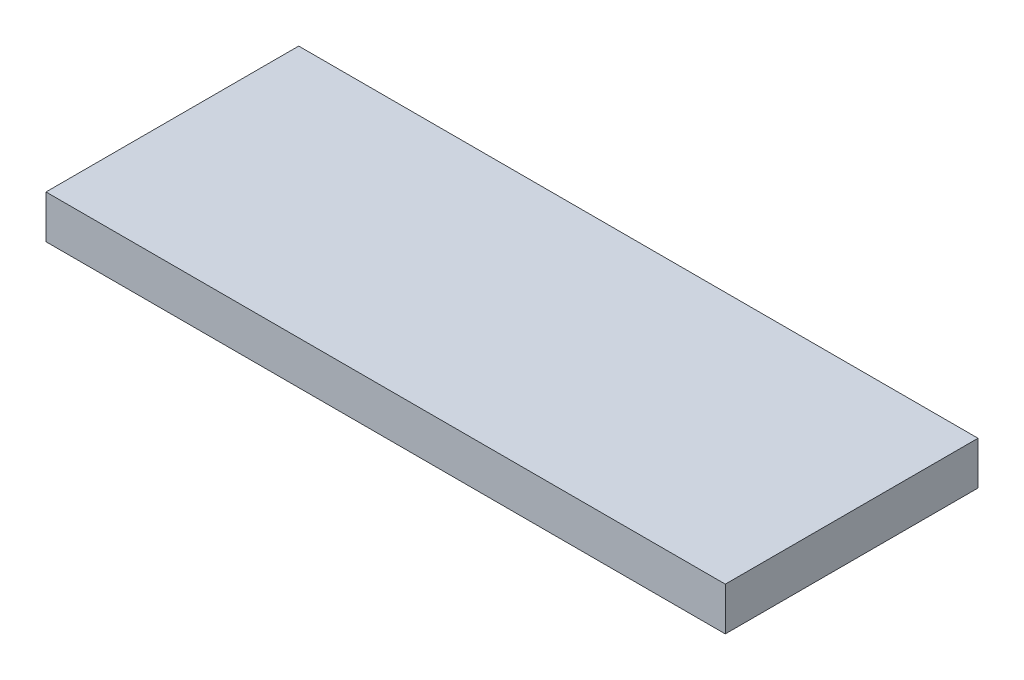
ISO-10303-21;
HEADER;
FILE_DESCRIPTION(('STEP AP214'),'2;1');
FILE_NAME('part.step','',(''),(''),'','','');
FILE_SCHEMA(('AUTOMOTIVE_DESIGN { 1 0 10303 214 1 1 1 1 }'));
ENDSEC;
DATA;
#1=APPLICATION_CONTEXT('core data for automotive mechanical design processes');
#2=APPLICATION_PROTOCOL_DEFINITION('international standard','automotive_design',2000,#1);
#3=PRODUCT_CONTEXT('',#1,'mechanical');
#4=PRODUCT('Part','Part','',(#3));
#5=PRODUCT_RELATED_PRODUCT_CATEGORY('part','',(#4));
#6=PRODUCT_DEFINITION_FORMATION('','',#4);
#7=PRODUCT_DEFINITION_CONTEXT('part definition',#1,'design');
#8=PRODUCT_DEFINITION('design','',#6,#7);
#9=PRODUCT_DEFINITION_SHAPE('','',#8);
#10=(LENGTH_UNIT() NAMED_UNIT(*) SI_UNIT(.MILLI.,.METRE.));
#11=(NAMED_UNIT(*) PLANE_ANGLE_UNIT() SI_UNIT($,.RADIAN.));
#12=(NAMED_UNIT(*) SI_UNIT($,.STERADIAN.) SOLID_ANGLE_UNIT());
#13=UNCERTAINTY_MEASURE_WITH_UNIT(LENGTH_MEASURE(1.E-05),#10,'distance_accuracy_value','');
#14=(GEOMETRIC_REPRESENTATION_CONTEXT(3) GLOBAL_UNCERTAINTY_ASSIGNED_CONTEXT((#13)) GLOBAL_UNIT_ASSIGNED_CONTEXT((#10,
#11,#12)) REPRESENTATION_CONTEXT('',''));
#15=CARTESIAN_POINT('',(0.,0.,0.));
#16=DIRECTION('',(0.,0.,1.));
#17=DIRECTION('',(1.,0.,0.));
#18=AXIS2_PLACEMENT_3D('',#15,#16,#17);
#19=CARTESIAN_POINT('',(0.,3.175,0.));
#20=DIRECTION('',(-1.,0.,0.));
#21=DIRECTION('',(0.,0.,1.));
#22=AXIS2_PLACEMENT_3D('',#19,#20,#21);
#23=PLANE('',#22);
#24=DIRECTION('',(0.,0.,-1.));
#25=VECTOR('',#24,1.);
#26=CARTESIAN_POINT('',(0.,0.,0.));
#27=LINE('',#26,#25);
#28=CARTESIAN_POINT('',(0.,0.,0.));
#29=VERTEX_POINT('',#28);
#30=CARTESIAN_POINT('',(0.,0.,-18.6));
#31=VERTEX_POINT('',#30);
#32=EDGE_CURVE('E98',#29,#31,#27,.T.);
#33=ORIENTED_EDGE('',*,*,#32,.F.);
#34=DIRECTION('',(0.,-1.,0.));
#35=VECTOR('',#34,1.);
#36=CARTESIAN_POINT('',(0.,3.175,0.));
#37=LINE('',#36,#35);
#38=CARTESIAN_POINT('',(0.,3.175,0.));
#39=VERTEX_POINT('',#38);
#40=EDGE_CURVE('E11',#39,#29,#37,.T.);
#41=ORIENTED_EDGE('',*,*,#40,.F.);
#42=DIRECTION('',(0.,0.,-1.));
#43=VECTOR('',#42,1.);
#44=CARTESIAN_POINT('',(0.,3.175,0.));
#45=LINE('',#44,#43);
#46=CARTESIAN_POINT('',(0.,3.175,-18.6));
#47=VERTEX_POINT('',#46);
#48=EDGE_CURVE('E93',#39,#47,#45,.T.);
#49=ORIENTED_EDGE('',*,*,#48,.T.);
#50=DIRECTION('',(0.,-1.,0.));
#51=VECTOR('',#50,1.);
#52=CARTESIAN_POINT('',(0.,3.175,-18.6));
#53=LINE('',#52,#51);
#54=EDGE_CURVE('E36',#47,#31,#53,.T.);
#55=ORIENTED_EDGE('',*,*,#54,.T.);
#56=EDGE_LOOP('',(#33,#41,#49,#55));
#57=FACE_BOUND('',#56,.T.);
#58=ADVANCED_FACE('F33',(#57),#23,.T.);
#59=CARTESIAN_POINT('',(0.,3.175,0.));
#60=DIRECTION('',(0.,0.,-1.));
#61=DIRECTION('',(-1.,0.,0.));
#62=AXIS2_PLACEMENT_3D('',#59,#60,#61);
#63=PLANE('',#62);
#64=DIRECTION('',(1.,0.,0.));
#65=VECTOR('',#64,1.);
#66=CARTESIAN_POINT('',(0.,0.,0.));
#67=LINE('',#66,#65);
#68=CARTESIAN_POINT('',(50.,0.,0.));
#69=VERTEX_POINT('',#68);
#70=EDGE_CURVE('E66',#29,#69,#67,.T.);
#71=ORIENTED_EDGE('',*,*,#70,.T.);
#72=DIRECTION('',(0.,-1.,0.));
#73=VECTOR('',#72,1.);
#74=CARTESIAN_POINT('',(50.,3.175,0.));
#75=LINE('',#74,#73);
#76=CARTESIAN_POINT('',(50.,3.175,0.));
#77=VERTEX_POINT('',#76);
#78=EDGE_CURVE('E42',#77,#69,#75,.T.);
#79=ORIENTED_EDGE('',*,*,#78,.F.);
#80=DIRECTION('',(1.,0.,0.));
#81=VECTOR('',#80,1.);
#82=CARTESIAN_POINT('',(0.,3.175,0.));
#83=LINE('',#82,#81);
#84=EDGE_CURVE('E83',#39,#77,#83,.T.);
#85=ORIENTED_EDGE('',*,*,#84,.F.);
#86=ORIENTED_EDGE('',*,*,#40,.T.);
#87=EDGE_LOOP('',(#71,#79,#85,#86));
#88=FACE_BOUND('',#87,.T.);
#89=ADVANCED_FACE('F108',(#88),#63,.F.);
#90=CARTESIAN_POINT('',(50.,3.175,0.));
#91=DIRECTION('',(-1.,0.,0.));
#92=DIRECTION('',(0.,0.,1.));
#93=AXIS2_PLACEMENT_3D('',#90,#91,#92);
#94=PLANE('',#93);
#95=DIRECTION('',(0.,0.,-1.));
#96=VECTOR('',#95,1.);
#97=CARTESIAN_POINT('',(50.,0.,0.));
#98=LINE('',#97,#96);
#99=CARTESIAN_POINT('',(50.,0.,-18.6));
#100=VERTEX_POINT('',#99);
#101=EDGE_CURVE('E90',#69,#100,#98,.T.);
#102=ORIENTED_EDGE('',*,*,#101,.T.);
#103=DIRECTION('',(0.,-1.,0.));
#104=VECTOR('',#103,1.);
#105=CARTESIAN_POINT('',(50.,3.175,-18.6));
#106=LINE('',#105,#104);
#107=CARTESIAN_POINT('',(50.,3.175,-18.6));
#108=VERTEX_POINT('',#107);
#109=EDGE_CURVE('E87',#108,#100,#106,.T.);
#110=ORIENTED_EDGE('',*,*,#109,.F.);
#111=DIRECTION('',(0.,0.,-1.));
#112=VECTOR('',#111,1.);
#113=CARTESIAN_POINT('',(50.,3.175,0.));
#114=LINE('',#113,#112);
#115=EDGE_CURVE('E78',#77,#108,#114,.T.);
#116=ORIENTED_EDGE('',*,*,#115,.F.);
#117=ORIENTED_EDGE('',*,*,#78,.T.);
#118=EDGE_LOOP('',(#102,#110,#116,#117));
#119=FACE_BOUND('',#118,.T.);
#120=ADVANCED_FACE('F88',(#119),#94,.F.);
#121=CARTESIAN_POINT('',(0.,3.175,-18.6));
#122=DIRECTION('',(0.,0.,-1.));
#123=DIRECTION('',(-1.,0.,0.));
#124=AXIS2_PLACEMENT_3D('',#121,#122,#123);
#125=PLANE('',#124);
#126=DIRECTION('',(1.,0.,0.));
#127=VECTOR('',#126,1.);
#128=CARTESIAN_POINT('',(0.,0.,-18.6));
#129=LINE('',#128,#127);
#130=EDGE_CURVE('E101',#31,#100,#129,.T.);
#131=ORIENTED_EDGE('',*,*,#130,.F.);
#132=ORIENTED_EDGE('',*,*,#54,.F.);
#133=DIRECTION('',(1.,0.,0.));
#134=VECTOR('',#133,1.);
#135=CARTESIAN_POINT('',(0.,3.175,-18.6));
#136=LINE('',#135,#134);
#137=EDGE_CURVE('E82',#47,#108,#136,.T.);
#138=ORIENTED_EDGE('',*,*,#137,.T.);
#139=ORIENTED_EDGE('',*,*,#109,.T.);
#140=EDGE_LOOP('',(#131,#132,#138,#139));
#141=FACE_BOUND('',#140,.T.);
#142=ADVANCED_FACE('F92',(#141),#125,.T.);
#143=CARTESIAN_POINT('',(0.,3.175,0.));
#144=DIRECTION('',(0.,-1.,0.));
#145=DIRECTION('',(0.,0.,-1.));
#146=AXIS2_PLACEMENT_3D('',#143,#144,#145);
#147=PLANE('',#146);
#148=ORIENTED_EDGE('',*,*,#48,.F.);
#149=ORIENTED_EDGE('',*,*,#84,.T.);
#150=ORIENTED_EDGE('',*,*,#115,.T.);
#151=ORIENTED_EDGE('',*,*,#137,.F.);
#152=EDGE_LOOP('',(#148,#149,#150,#151));
#153=FACE_BOUND('',#152,.T.);
#154=ADVANCED_FACE('F81',(#153),#147,.F.);
#155=CARTESIAN_POINT('',(0.,0.,0.));
#156=DIRECTION('',(0.,-1.,0.));
#157=DIRECTION('',(0.,0.,-1.));
#158=AXIS2_PLACEMENT_3D('',#155,#156,#157);
#159=PLANE('',#158);
#160=ORIENTED_EDGE('',*,*,#32,.T.);
#161=ORIENTED_EDGE('',*,*,#130,.T.);
#162=ORIENTED_EDGE('',*,*,#101,.F.);
#163=ORIENTED_EDGE('',*,*,#70,.F.);
#164=EDGE_LOOP('',(#160,#161,#162,#163));
#165=FACE_BOUND('',#164,.T.);
#166=ADVANCED_FACE('F106',(#165),#159,.T.);
#167=CLOSED_SHELL('',(#58,#89,#120,#142,#154,#166));
#168=MANIFOLD_SOLID_BREP('B2',#167);
#169=ADVANCED_BREP_SHAPE_REPRESENTATION('',(#18,#168),#14);
#170=SHAPE_DEFINITION_REPRESENTATION(#9,#169);
ENDSEC;
END-ISO-10303-21;
